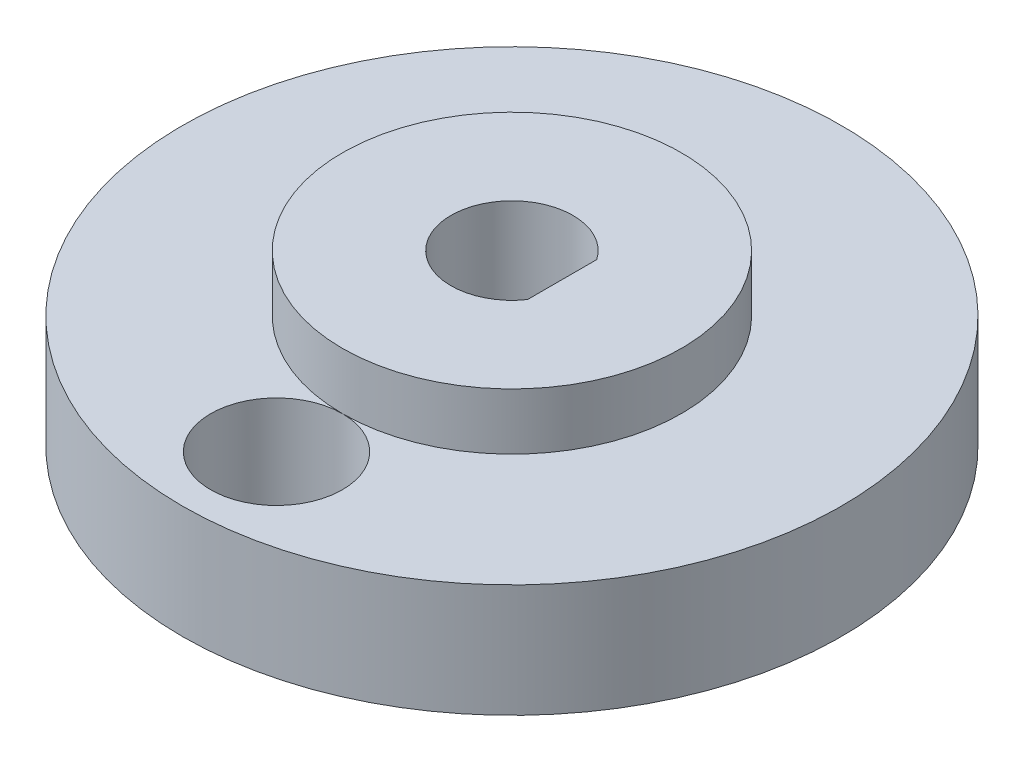
ISO-10303-21;
HEADER;
FILE_DESCRIPTION(('STEP AP214'),'2;1');
FILE_NAME('part.step','',(''),(''),'','','');
FILE_SCHEMA(('AUTOMOTIVE_DESIGN { 1 0 10303 214 1 1 1 1 }'));
ENDSEC;
DATA;
#1=APPLICATION_CONTEXT('core data for automotive mechanical design processes');
#2=APPLICATION_PROTOCOL_DEFINITION('international standard','automotive_design',2000,#1);
#3=PRODUCT_CONTEXT('',#1,'mechanical');
#4=PRODUCT('Part','Part','',(#3));
#5=PRODUCT_RELATED_PRODUCT_CATEGORY('part','',(#4));
#6=PRODUCT_DEFINITION_FORMATION('','',#4);
#7=PRODUCT_DEFINITION_CONTEXT('part definition',#1,'design');
#8=PRODUCT_DEFINITION('design','',#6,#7);
#9=PRODUCT_DEFINITION_SHAPE('','',#8);
#10=(LENGTH_UNIT() NAMED_UNIT(*) SI_UNIT(.MILLI.,.METRE.));
#11=(NAMED_UNIT(*) PLANE_ANGLE_UNIT() SI_UNIT($,.RADIAN.));
#12=(NAMED_UNIT(*) SI_UNIT($,.STERADIAN.) SOLID_ANGLE_UNIT());
#13=UNCERTAINTY_MEASURE_WITH_UNIT(LENGTH_MEASURE(1.E-05),#10,'distance_accuracy_value','');
#14=(GEOMETRIC_REPRESENTATION_CONTEXT(3) GLOBAL_UNCERTAINTY_ASSIGNED_CONTEXT((#13)) GLOBAL_UNIT_ASSIGNED_CONTEXT((#10,
#11,#12)) REPRESENTATION_CONTEXT('',''));
#15=CARTESIAN_POINT('',(0.,0.,0.));
#16=DIRECTION('',(0.,0.,1.));
#17=DIRECTION('',(1.,0.,0.));
#18=AXIS2_PLACEMENT_3D('',#15,#16,#17);
#19=CARTESIAN_POINT('',(0.,6.,0.));
#20=DIRECTION('',(0.,-1.,0.));
#21=DIRECTION('',(0.,0.,-1.));
#22=AXIS2_PLACEMENT_3D('',#19,#20,#21);
#23=CYLINDRICAL_SURFACE('',#22,17.5);
#24=CARTESIAN_POINT('',(0.,6.,0.));
#25=DIRECTION('',(0.,1.,0.));
#26=DIRECTION('',(0.,0.,1.));
#27=AXIS2_PLACEMENT_3D('',#24,#25,#26);
#28=CIRCLE('',#27,17.5);
#29=CARTESIAN_POINT('',(0.,6.,17.5));
#30=VERTEX_POINT('',#29);
#31=EDGE_CURVE('E47',#30,#30,#28,.T.);
#32=ORIENTED_EDGE('',*,*,#31,.F.);
#33=EDGE_LOOP('',(#32));
#34=FACE_BOUND('',#33,.T.);
#35=CARTESIAN_POINT('',(0.,0.,0.));
#36=DIRECTION('',(0.,1.,0.));
#37=DIRECTION('',(0.,0.,1.));
#38=AXIS2_PLACEMENT_3D('',#35,#36,#37);
#39=CIRCLE('',#38,17.5);
#40=CARTESIAN_POINT('',(0.,0.,17.5));
#41=VERTEX_POINT('',#40);
#42=EDGE_CURVE('E41',#41,#41,#39,.T.);
#43=ORIENTED_EDGE('',*,*,#42,.T.);
#44=EDGE_LOOP('',(#43));
#45=FACE_BOUND('',#44,.T.);
#46=ADVANCED_FACE('F38',(#34,#45),#23,.T.);
#47=CARTESIAN_POINT('',(0.,6.,0.));
#48=DIRECTION('',(0.,1.,0.));
#49=DIRECTION('',(0.,0.,1.));
#50=AXIS2_PLACEMENT_3D('',#47,#48,#49);
#51=PLANE('',#50);
#52=CARTESIAN_POINT('',(0.,6.,0.));
#53=DIRECTION('',(0.,1.,0.));
#54=DIRECTION('',(0.,0.,1.));
#55=AXIS2_PLACEMENT_3D('',#52,#53,#54);
#56=CIRCLE('',#55,9.);
#57=CARTESIAN_POINT('',(0.,6.,9.));
#58=VERTEX_POINT('',#57);
#59=EDGE_CURVE('E11',#58,#58,#56,.T.);
#60=ORIENTED_EDGE('',*,*,#59,.F.);
#61=CARTESIAN_POINT('',(0.,6.,12.5));
#62=DIRECTION('',(0.,1.,0.));
#63=DIRECTION('',(0.,0.,1.));
#64=AXIS2_PLACEMENT_3D('',#61,#62,#63);
#65=CIRCLE('',#64,3.5);
#66=EDGE_CURVE('E53',#58,#58,#65,.F.);
#67=ORIENTED_EDGE('',*,*,#66,.T.);
#68=EDGE_LOOP('',(#60,#67));
#69=FACE_BOUND('',#68,.T.);
#70=ORIENTED_EDGE('',*,*,#31,.T.);
#71=EDGE_LOOP('',(#70));
#72=FACE_BOUND('',#71,.T.);
#73=ADVANCED_FACE('F113',(#69,#72),#51,.T.);
#74=CARTESIAN_POINT('',(0.,0.,0.));
#75=DIRECTION('',(0.,1.,0.));
#76=DIRECTION('',(0.,0.,1.));
#77=AXIS2_PLACEMENT_3D('',#74,#75,#76);
#78=PLANE('',#77);
#79=CARTESIAN_POINT('',(0.,0.,12.5));
#80=DIRECTION('',(0.,1.,0.));
#81=DIRECTION('',(0.,0.,1.));
#82=AXIS2_PLACEMENT_3D('',#79,#80,#81);
#83=CIRCLE('',#82,3.5);
#84=CARTESIAN_POINT('',(0.,0.,16.));
#85=VERTEX_POINT('',#84);
#86=EDGE_CURVE('E183',#85,#85,#83,.T.);
#87=ORIENTED_EDGE('',*,*,#86,.T.);
#88=EDGE_LOOP('',(#87));
#89=FACE_BOUND('',#88,.T.);
#90=DIRECTION('',(0.,0.,1.));
#91=VECTOR('',#90,1.);
#92=CARTESIAN_POINT('',(2.667,0.,0.));
#93=LINE('',#92,#91);
#94=CARTESIAN_POINT('',(2.667,0.,-1.83711546996916));
#95=VERTEX_POINT('',#94);
#96=CARTESIAN_POINT('',(2.667,0.,1.83711546996916));
#97=VERTEX_POINT('',#96);
#98=EDGE_CURVE('E72',#95,#97,#93,.T.);
#99=ORIENTED_EDGE('',*,*,#98,.F.);
#100=CARTESIAN_POINT('',(0.,0.,0.));
#101=DIRECTION('',(0.,1.,0.));
#102=DIRECTION('',(0.,0.,1.));
#103=AXIS2_PLACEMENT_3D('',#100,#101,#102);
#104=CIRCLE('',#103,3.2385);
#105=EDGE_CURVE('E60',#95,#97,#104,.T.);
#106=ORIENTED_EDGE('',*,*,#105,.T.);
#107=EDGE_LOOP('',(#99,#106));
#108=FACE_BOUND('',#107,.T.);
#109=ORIENTED_EDGE('',*,*,#42,.F.);
#110=EDGE_LOOP('',(#109));
#111=FACE_BOUND('',#110,.T.);
#112=ADVANCED_FACE('F86',(#89,#108,#111),#78,.F.);
#113=CARTESIAN_POINT('',(0.,9.,0.));
#114=DIRECTION('',(0.,-1.,0.));
#115=DIRECTION('',(0.,0.,-1.));
#116=AXIS2_PLACEMENT_3D('',#113,#114,#115);
#117=CYLINDRICAL_SURFACE('',#116,9.);
#118=ORIENTED_EDGE('',*,*,#59,.T.);
#119=EDGE_LOOP('',(#118));
#120=FACE_BOUND('',#119,.T.);
#121=CARTESIAN_POINT('',(0.,9.,0.));
#122=DIRECTION('',(0.,1.,0.));
#123=DIRECTION('',(0.,0.,1.));
#124=AXIS2_PLACEMENT_3D('',#121,#122,#123);
#125=CIRCLE('',#124,9.);
#126=CARTESIAN_POINT('',(0.,9.,9.));
#127=VERTEX_POINT('',#126);
#128=EDGE_CURVE('E99',#127,#127,#125,.T.);
#129=ORIENTED_EDGE('',*,*,#128,.F.);
#130=EDGE_LOOP('',(#129));
#131=FACE_BOUND('',#130,.T.);
#132=ADVANCED_FACE('F112',(#120,#131),#117,.T.);
#133=CARTESIAN_POINT('',(0.,9.,0.));
#134=DIRECTION('',(0.,1.,0.));
#135=DIRECTION('',(0.,0.,1.));
#136=AXIS2_PLACEMENT_3D('',#133,#134,#135);
#137=PLANE('',#136);
#138=CARTESIAN_POINT('',(0.,9.,0.));
#139=DIRECTION('',(0.,1.,0.));
#140=DIRECTION('',(0.,0.,1.));
#141=AXIS2_PLACEMENT_3D('',#138,#139,#140);
#142=CIRCLE('',#141,3.2385);
#143=CARTESIAN_POINT('',(2.667,9.,-1.83711546996916));
#144=VERTEX_POINT('',#143);
#145=CARTESIAN_POINT('',(2.667,9.,1.83711546996916));
#146=VERTEX_POINT('',#145);
#147=EDGE_CURVE('E83',#144,#146,#142,.T.);
#148=ORIENTED_EDGE('',*,*,#147,.F.);
#149=DIRECTION('',(0.,0.,1.));
#150=VECTOR('',#149,1.);
#151=CARTESIAN_POINT('',(2.667,9.,0.));
#152=LINE('',#151,#150);
#153=EDGE_CURVE('E89',#144,#146,#152,.T.);
#154=ORIENTED_EDGE('',*,*,#153,.T.);
#155=EDGE_LOOP('',(#148,#154));
#156=FACE_BOUND('',#155,.T.);
#157=ORIENTED_EDGE('',*,*,#128,.T.);
#158=EDGE_LOOP('',(#157));
#159=FACE_BOUND('',#158,.T.);
#160=ADVANCED_FACE('F119',(#156,#159),#137,.T.);
#161=CARTESIAN_POINT('',(0.,0.,0.));
#162=DIRECTION('',(0.,1.,0.));
#163=DIRECTION('',(0.,0.,1.));
#164=AXIS2_PLACEMENT_3D('',#161,#162,#163);
#165=CYLINDRICAL_SURFACE('',#164,3.2385);
#166=ORIENTED_EDGE('',*,*,#147,.T.);
#167=DIRECTION('',(0.,1.,0.));
#168=VECTOR('',#167,1.);
#169=CARTESIAN_POINT('',(2.667,0.,1.83711546996916));
#170=LINE('',#169,#168);
#171=EDGE_CURVE('E75',#97,#146,#170,.T.);
#172=ORIENTED_EDGE('',*,*,#171,.F.);
#173=ORIENTED_EDGE('',*,*,#105,.F.);
#174=DIRECTION('',(0.,1.,0.));
#175=VECTOR('',#174,1.);
#176=CARTESIAN_POINT('',(2.667,0.,-1.83711546996916));
#177=LINE('',#176,#175);
#178=EDGE_CURVE('E77',#95,#144,#177,.T.);
#179=ORIENTED_EDGE('',*,*,#178,.T.);
#180=EDGE_LOOP('',(#166,#172,#173,#179));
#181=FACE_BOUND('',#180,.T.);
#182=ADVANCED_FACE('F81',(#181),#165,.F.);
#183=CARTESIAN_POINT('',(2.667,0.,0.));
#184=DIRECTION('',(-1.,0.,0.));
#185=DIRECTION('',(0.,0.,1.));
#186=AXIS2_PLACEMENT_3D('',#183,#184,#185);
#187=PLANE('',#186);
#188=ORIENTED_EDGE('',*,*,#153,.F.);
#189=ORIENTED_EDGE('',*,*,#178,.F.);
#190=ORIENTED_EDGE('',*,*,#98,.T.);
#191=ORIENTED_EDGE('',*,*,#171,.T.);
#192=EDGE_LOOP('',(#188,#189,#190,#191));
#193=FACE_BOUND('',#192,.T.);
#194=ADVANCED_FACE('F74',(#193),#187,.T.);
#195=CARTESIAN_POINT('',(0.,9.,12.5));
#196=DIRECTION('',(0.,-1.,0.));
#197=DIRECTION('',(0.,0.,-1.));
#198=AXIS2_PLACEMENT_3D('',#195,#196,#197);
#199=CYLINDRICAL_SURFACE('',#198,3.5);
#200=ORIENTED_EDGE('',*,*,#66,.F.);
#201=EDGE_LOOP('',(#200));
#202=FACE_BOUND('',#201,.T.);
#203=ORIENTED_EDGE('',*,*,#86,.F.);
#204=EDGE_LOOP('',(#203));
#205=FACE_BOUND('',#204,.T.);
#206=ADVANCED_FACE('F167',(#202,#205),#199,.F.);
#207=CLOSED_SHELL('',(#46,#73,#112,#132,#160,#182,#194,#206));
#208=MANIFOLD_SOLID_BREP('B2',#207);
#209=ADVANCED_BREP_SHAPE_REPRESENTATION('',(#18,#208),#14);
#210=SHAPE_DEFINITION_REPRESENTATION(#9,#209);
ENDSEC;
END-ISO-10303-21;
